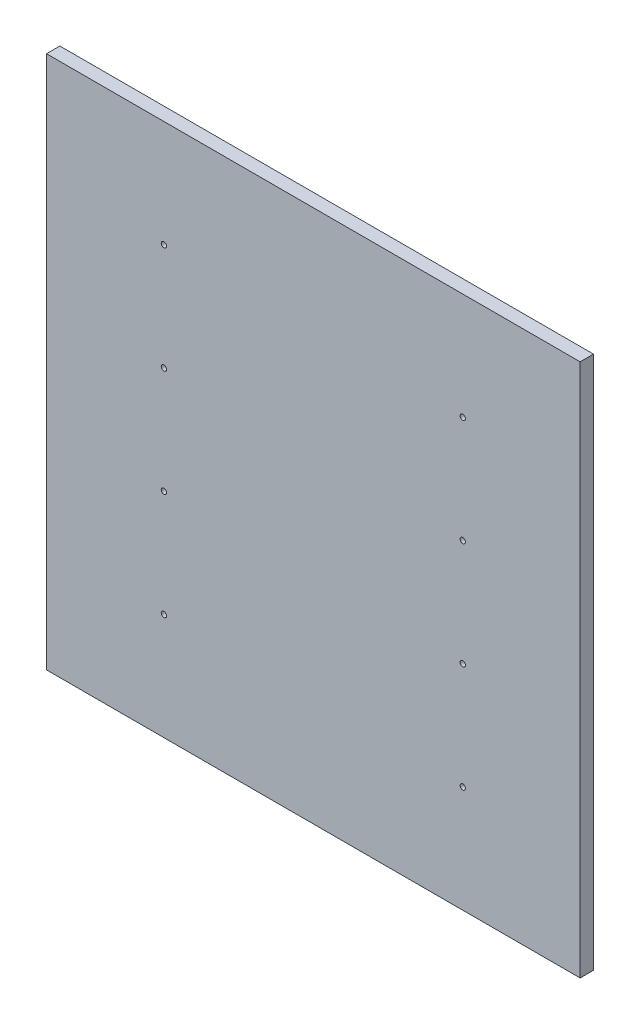
ISO-10303-21;
HEADER;
FILE_DESCRIPTION(('STEP AP214'),'2;1');
FILE_NAME('part.step','',(''),(''),'','','');
FILE_SCHEMA(('AUTOMOTIVE_DESIGN { 1 0 10303 214 1 1 1 1 }'));
ENDSEC;
DATA;
#1=APPLICATION_CONTEXT('core data for automotive mechanical design processes');
#2=APPLICATION_PROTOCOL_DEFINITION('international standard','automotive_design',2000,#1);
#3=PRODUCT_CONTEXT('',#1,'mechanical');
#4=PRODUCT('Part','Part','',(#3));
#5=PRODUCT_RELATED_PRODUCT_CATEGORY('part','',(#4));
#6=PRODUCT_DEFINITION_FORMATION('','',#4);
#7=PRODUCT_DEFINITION_CONTEXT('part definition',#1,'design');
#8=PRODUCT_DEFINITION('design','',#6,#7);
#9=PRODUCT_DEFINITION_SHAPE('','',#8);
#10=(LENGTH_UNIT() NAMED_UNIT(*) SI_UNIT(.MILLI.,.METRE.));
#11=(NAMED_UNIT(*) PLANE_ANGLE_UNIT() SI_UNIT($,.RADIAN.));
#12=(NAMED_UNIT(*) SI_UNIT($,.STERADIAN.) SOLID_ANGLE_UNIT());
#13=UNCERTAINTY_MEASURE_WITH_UNIT(LENGTH_MEASURE(1.E-05),#10,'distance_accuracy_value','');
#14=(GEOMETRIC_REPRESENTATION_CONTEXT(3) GLOBAL_UNCERTAINTY_ASSIGNED_CONTEXT((#13)) GLOBAL_UNIT_ASSIGNED_CONTEXT((#10,
#11,#12)) REPRESENTATION_CONTEXT('',''));
#15=CARTESIAN_POINT('',(0.,0.,0.));
#16=DIRECTION('',(0.,0.,1.));
#17=DIRECTION('',(1.,0.,0.));
#18=AXIS2_PLACEMENT_3D('',#15,#16,#17);
#19=CARTESIAN_POINT('',(45.,0.,1.));
#20=DIRECTION('',(1.,0.,0.));
#21=DIRECTION('',(0.,1.,0.));
#22=AXIS2_PLACEMENT_3D('',#19,#20,#21);
#23=PLANE('',#22);
#24=DIRECTION('',(0.,-1.,0.));
#25=VECTOR('',#24,1.);
#26=CARTESIAN_POINT('',(45.,0.,0.));
#27=LINE('',#26,#25);
#28=CARTESIAN_POINT('',(45.,-5.,0.));
#29=VERTEX_POINT('',#28);
#30=CARTESIAN_POINT('',(45.,-45.,0.));
#31=VERTEX_POINT('',#30);
#32=EDGE_CURVE('E98',#29,#31,#27,.T.);
#33=ORIENTED_EDGE('',*,*,#32,.F.);
#34=DIRECTION('',(0.,0.,-1.));
#35=VECTOR('',#34,1.);
#36=CARTESIAN_POINT('',(45.,-5.,1.));
#37=LINE('',#36,#35);
#38=CARTESIAN_POINT('',(45.,-5.,1.));
#39=VERTEX_POINT('',#38);
#40=EDGE_CURVE('E11',#39,#29,#37,.T.);
#41=ORIENTED_EDGE('',*,*,#40,.F.);
#42=DIRECTION('',(0.,-1.,0.));
#43=VECTOR('',#42,1.);
#44=CARTESIAN_POINT('',(45.,0.,1.));
#45=LINE('',#44,#43);
#46=CARTESIAN_POINT('',(45.,-45.,1.));
#47=VERTEX_POINT('',#46);
#48=EDGE_CURVE('E91',#39,#47,#45,.T.);
#49=ORIENTED_EDGE('',*,*,#48,.T.);
#50=DIRECTION('',(0.,0.,-1.));
#51=VECTOR('',#50,1.);
#52=CARTESIAN_POINT('',(45.,-45.,1.));
#53=LINE('',#52,#51);
#54=EDGE_CURVE('E72',#47,#31,#53,.T.);
#55=ORIENTED_EDGE('',*,*,#54,.T.);
#56=EDGE_LOOP('',(#33,#41,#49,#55));
#57=FACE_BOUND('',#56,.T.);
#58=ADVANCED_FACE('F34',(#57),#23,.T.);
#59=CARTESIAN_POINT('',(0.,-5.,1.));
#60=DIRECTION('',(0.,1.,0.));
#61=DIRECTION('',(0.,0.,1.));
#62=AXIS2_PLACEMENT_3D('',#59,#60,#61);
#63=PLANE('',#62);
#64=DIRECTION('',(1.,0.,0.));
#65=VECTOR('',#64,1.);
#66=CARTESIAN_POINT('',(0.,-5.,0.));
#67=LINE('',#66,#65);
#68=CARTESIAN_POINT('',(5.,-5.,0.));
#69=VERTEX_POINT('',#68);
#70=EDGE_CURVE('E85',#69,#29,#67,.T.);
#71=ORIENTED_EDGE('',*,*,#70,.F.);
#72=DIRECTION('',(0.,0.,-1.));
#73=VECTOR('',#72,1.);
#74=CARTESIAN_POINT('',(5.,-5.,1.));
#75=LINE('',#74,#73);
#76=CARTESIAN_POINT('',(5.,-5.,1.));
#77=VERTEX_POINT('',#76);
#78=EDGE_CURVE('E42',#77,#69,#75,.T.);
#79=ORIENTED_EDGE('',*,*,#78,.F.);
#80=DIRECTION('',(1.,0.,0.));
#81=VECTOR('',#80,1.);
#82=CARTESIAN_POINT('',(0.,-5.,1.));
#83=LINE('',#82,#81);
#84=EDGE_CURVE('E83',#77,#39,#83,.T.);
#85=ORIENTED_EDGE('',*,*,#84,.T.);
#86=ORIENTED_EDGE('',*,*,#40,.T.);
#87=EDGE_LOOP('',(#71,#79,#85,#86));
#88=FACE_BOUND('',#87,.T.);
#89=ADVANCED_FACE('F81',(#88),#63,.T.);
#90=CARTESIAN_POINT('',(5.,0.,1.));
#91=DIRECTION('',(1.,0.,0.));
#92=DIRECTION('',(0.,1.,0.));
#93=AXIS2_PLACEMENT_3D('',#90,#91,#92);
#94=PLANE('',#93);
#95=DIRECTION('',(0.,-1.,0.));
#96=VECTOR('',#95,1.);
#97=CARTESIAN_POINT('',(5.,0.,0.));
#98=LINE('',#97,#96);
#99=CARTESIAN_POINT('',(5.,-45.,0.));
#100=VERTEX_POINT('',#99);
#101=EDGE_CURVE('E65',#69,#100,#98,.T.);
#102=ORIENTED_EDGE('',*,*,#101,.T.);
#103=DIRECTION('',(0.,0.,-1.));
#104=VECTOR('',#103,1.);
#105=CARTESIAN_POINT('',(5.,-45.,1.));
#106=LINE('',#105,#104);
#107=CARTESIAN_POINT('',(5.,-45.,1.));
#108=VERTEX_POINT('',#107);
#109=EDGE_CURVE('E86',#108,#100,#106,.T.);
#110=ORIENTED_EDGE('',*,*,#109,.F.);
#111=DIRECTION('',(0.,-1.,0.));
#112=VECTOR('',#111,1.);
#113=CARTESIAN_POINT('',(5.,0.,1.));
#114=LINE('',#113,#112);
#115=EDGE_CURVE('E87',#77,#108,#114,.T.);
#116=ORIENTED_EDGE('',*,*,#115,.F.);
#117=ORIENTED_EDGE('',*,*,#78,.T.);
#118=EDGE_LOOP('',(#102,#110,#116,#117));
#119=FACE_BOUND('',#118,.T.);
#120=ADVANCED_FACE('F88',(#119),#94,.F.);
#121=CARTESIAN_POINT('',(0.,-45.,1.));
#122=DIRECTION('',(0.,1.,0.));
#123=DIRECTION('',(0.,0.,1.));
#124=AXIS2_PLACEMENT_3D('',#121,#122,#123);
#125=PLANE('',#124);
#126=DIRECTION('',(1.,0.,0.));
#127=VECTOR('',#126,1.);
#128=CARTESIAN_POINT('',(0.,-45.,0.));
#129=LINE('',#128,#127);
#130=EDGE_CURVE('E93',#100,#31,#129,.T.);
#131=ORIENTED_EDGE('',*,*,#130,.T.);
#132=ORIENTED_EDGE('',*,*,#54,.F.);
#133=DIRECTION('',(1.,0.,0.));
#134=VECTOR('',#133,1.);
#135=CARTESIAN_POINT('',(0.,-45.,1.));
#136=LINE('',#135,#134);
#137=EDGE_CURVE('E50',#108,#47,#136,.T.);
#138=ORIENTED_EDGE('',*,*,#137,.F.);
#139=ORIENTED_EDGE('',*,*,#109,.T.);
#140=EDGE_LOOP('',(#131,#132,#138,#139));
#141=FACE_BOUND('',#140,.T.);
#142=ADVANCED_FACE('F108',(#141),#125,.F.);
#143=CARTESIAN_POINT('',(0.,0.,1.));
#144=DIRECTION('',(0.,0.,1.));
#145=DIRECTION('',(1.,0.,0.));
#146=AXIS2_PLACEMENT_3D('',#143,#144,#145);
#147=PLANE('',#146);
#148=CARTESIAN_POINT('',(13.8,-21.,1.));
#149=DIRECTION('',(0.,0.,1.));
#150=DIRECTION('',(1.,0.,0.));
#151=AXIS2_PLACEMENT_3D('',#148,#149,#150);
#152=CIRCLE('',#151,0.2);
#153=CARTESIAN_POINT('',(14.,-21.,1.));
#154=VERTEX_POINT('',#153);
#155=EDGE_CURVE('E167',#154,#154,#152,.T.);
#156=ORIENTED_EDGE('',*,*,#155,.F.);
#157=EDGE_LOOP('',(#156));
#158=FACE_BOUND('',#157,.T.);
#159=CARTESIAN_POINT('',(13.8,-13.,1.));
#160=DIRECTION('',(0.,0.,1.));
#161=DIRECTION('',(1.,0.,0.));
#162=AXIS2_PLACEMENT_3D('',#159,#160,#161);
#163=CIRCLE('',#162,0.200000000000001);
#164=CARTESIAN_POINT('',(14.,-13.,1.));
#165=VERTEX_POINT('',#164);
#166=EDGE_CURVE('E171',#165,#165,#163,.T.);
#167=ORIENTED_EDGE('',*,*,#166,.F.);
#168=EDGE_LOOP('',(#167));
#169=FACE_BOUND('',#168,.T.);
#170=CARTESIAN_POINT('',(36.2,-13.,1.));
#171=DIRECTION('',(0.,0.,1.));
#172=DIRECTION('',(1.,0.,0.));
#173=AXIS2_PLACEMENT_3D('',#170,#171,#172);
#174=CIRCLE('',#173,0.199999999999996);
#175=CARTESIAN_POINT('',(36.4,-13.,1.));
#176=VERTEX_POINT('',#175);
#177=EDGE_CURVE('E178',#176,#176,#174,.T.);
#178=ORIENTED_EDGE('',*,*,#177,.F.);
#179=EDGE_LOOP('',(#178));
#180=FACE_BOUND('',#179,.T.);
#181=CARTESIAN_POINT('',(36.2,-21.,1.));
#182=DIRECTION('',(0.,0.,1.));
#183=DIRECTION('',(1.,0.,0.));
#184=AXIS2_PLACEMENT_3D('',#181,#182,#183);
#185=CIRCLE('',#184,0.199999999999995);
#186=CARTESIAN_POINT('',(36.4,-21.,1.));
#187=VERTEX_POINT('',#186);
#188=EDGE_CURVE('E184',#187,#187,#185,.T.);
#189=ORIENTED_EDGE('',*,*,#188,.F.);
#190=EDGE_LOOP('',(#189));
#191=FACE_BOUND('',#190,.T.);
#192=CARTESIAN_POINT('',(36.2,-37.,1.));
#193=DIRECTION('',(0.,0.,1.));
#194=DIRECTION('',(1.,0.,0.));
#195=AXIS2_PLACEMENT_3D('',#192,#193,#194);
#196=CIRCLE('',#195,0.199999999999995);
#197=CARTESIAN_POINT('',(36.4,-37.,1.));
#198=VERTEX_POINT('',#197);
#199=EDGE_CURVE('E190',#198,#198,#196,.T.);
#200=ORIENTED_EDGE('',*,*,#199,.F.);
#201=EDGE_LOOP('',(#200));
#202=FACE_BOUND('',#201,.T.);
#203=CARTESIAN_POINT('',(36.2,-29.,1.));
#204=DIRECTION('',(0.,0.,1.));
#205=DIRECTION('',(1.,0.,0.));
#206=AXIS2_PLACEMENT_3D('',#203,#204,#205);
#207=CIRCLE('',#206,0.199999999999995);
#208=CARTESIAN_POINT('',(36.4,-29.,1.));
#209=VERTEX_POINT('',#208);
#210=EDGE_CURVE('E196',#209,#209,#207,.T.);
#211=ORIENTED_EDGE('',*,*,#210,.F.);
#212=EDGE_LOOP('',(#211));
#213=FACE_BOUND('',#212,.T.);
#214=CARTESIAN_POINT('',(13.8,-29.,1.));
#215=DIRECTION('',(0.,0.,1.));
#216=DIRECTION('',(1.,0.,0.));
#217=AXIS2_PLACEMENT_3D('',#214,#215,#216);
#218=CIRCLE('',#217,0.2);
#219=CARTESIAN_POINT('',(14.,-29.,1.));
#220=VERTEX_POINT('',#219);
#221=EDGE_CURVE('E202',#220,#220,#218,.T.);
#222=ORIENTED_EDGE('',*,*,#221,.F.);
#223=EDGE_LOOP('',(#222));
#224=FACE_BOUND('',#223,.T.);
#225=CARTESIAN_POINT('',(13.8,-37.,1.));
#226=DIRECTION('',(0.,0.,1.));
#227=DIRECTION('',(1.,0.,0.));
#228=AXIS2_PLACEMENT_3D('',#225,#226,#227);
#229=CIRCLE('',#228,0.2);
#230=CARTESIAN_POINT('',(14.,-37.,1.));
#231=VERTEX_POINT('',#230);
#232=EDGE_CURVE('E205',#231,#231,#229,.T.);
#233=ORIENTED_EDGE('',*,*,#232,.F.);
#234=EDGE_LOOP('',(#233));
#235=FACE_BOUND('',#234,.T.);
#236=ORIENTED_EDGE('',*,*,#48,.F.);
#237=ORIENTED_EDGE('',*,*,#84,.F.);
#238=ORIENTED_EDGE('',*,*,#115,.T.);
#239=ORIENTED_EDGE('',*,*,#137,.T.);
#240=EDGE_LOOP('',(#236,#237,#238,#239));
#241=FACE_BOUND('',#240,.T.);
#242=ADVANCED_FACE('F90',(#158,#169,#180,#191,#202,#213,#224,#235,#241),#147,.T.);
#243=CARTESIAN_POINT('',(0.,0.,0.));
#244=DIRECTION('',(0.,0.,1.));
#245=DIRECTION('',(1.,0.,0.));
#246=AXIS2_PLACEMENT_3D('',#243,#244,#245);
#247=PLANE('',#246);
#248=CARTESIAN_POINT('',(13.8,-21.,0.));
#249=DIRECTION('',(0.,0.,1.));
#250=DIRECTION('',(1.,0.,0.));
#251=AXIS2_PLACEMENT_3D('',#248,#249,#250);
#252=CIRCLE('',#251,0.2);
#253=CARTESIAN_POINT('',(14.,-21.,0.));
#254=VERTEX_POINT('',#253);
#255=EDGE_CURVE('E164',#254,#254,#252,.T.);
#256=ORIENTED_EDGE('',*,*,#255,.T.);
#257=EDGE_LOOP('',(#256));
#258=FACE_BOUND('',#257,.T.);
#259=CARTESIAN_POINT('',(13.8,-13.,0.));
#260=DIRECTION('',(0.,0.,1.));
#261=DIRECTION('',(1.,0.,0.));
#262=AXIS2_PLACEMENT_3D('',#259,#260,#261);
#263=CIRCLE('',#262,0.200000000000001);
#264=CARTESIAN_POINT('',(14.,-13.,0.));
#265=VERTEX_POINT('',#264);
#266=EDGE_CURVE('E168',#265,#265,#263,.T.);
#267=ORIENTED_EDGE('',*,*,#266,.T.);
#268=EDGE_LOOP('',(#267));
#269=FACE_BOUND('',#268,.T.);
#270=CARTESIAN_POINT('',(36.2,-13.,0.));
#271=DIRECTION('',(0.,0.,1.));
#272=DIRECTION('',(1.,0.,0.));
#273=AXIS2_PLACEMENT_3D('',#270,#271,#272);
#274=CIRCLE('',#273,0.199999999999996);
#275=CARTESIAN_POINT('',(36.4,-13.,0.));
#276=VERTEX_POINT('',#275);
#277=EDGE_CURVE('E176',#276,#276,#274,.T.);
#278=ORIENTED_EDGE('',*,*,#277,.T.);
#279=EDGE_LOOP('',(#278));
#280=FACE_BOUND('',#279,.T.);
#281=CARTESIAN_POINT('',(36.2,-21.,0.));
#282=DIRECTION('',(0.,0.,1.));
#283=DIRECTION('',(1.,0.,0.));
#284=AXIS2_PLACEMENT_3D('',#281,#282,#283);
#285=CIRCLE('',#284,0.199999999999995);
#286=CARTESIAN_POINT('',(36.4,-21.,0.));
#287=VERTEX_POINT('',#286);
#288=EDGE_CURVE('E181',#287,#287,#285,.T.);
#289=ORIENTED_EDGE('',*,*,#288,.T.);
#290=EDGE_LOOP('',(#289));
#291=FACE_BOUND('',#290,.T.);
#292=CARTESIAN_POINT('',(36.2,-37.,0.));
#293=DIRECTION('',(0.,0.,1.));
#294=DIRECTION('',(1.,0.,0.));
#295=AXIS2_PLACEMENT_3D('',#292,#293,#294);
#296=CIRCLE('',#295,0.199999999999995);
#297=CARTESIAN_POINT('',(36.4,-37.,0.));
#298=VERTEX_POINT('',#297);
#299=EDGE_CURVE('E187',#298,#298,#296,.T.);
#300=ORIENTED_EDGE('',*,*,#299,.T.);
#301=EDGE_LOOP('',(#300));
#302=FACE_BOUND('',#301,.T.);
#303=CARTESIAN_POINT('',(36.2,-29.,0.));
#304=DIRECTION('',(0.,0.,1.));
#305=DIRECTION('',(1.,0.,0.));
#306=AXIS2_PLACEMENT_3D('',#303,#304,#305);
#307=CIRCLE('',#306,0.199999999999995);
#308=CARTESIAN_POINT('',(36.4,-29.,0.));
#309=VERTEX_POINT('',#308);
#310=EDGE_CURVE('E193',#309,#309,#307,.T.);
#311=ORIENTED_EDGE('',*,*,#310,.T.);
#312=EDGE_LOOP('',(#311));
#313=FACE_BOUND('',#312,.T.);
#314=CARTESIAN_POINT('',(13.8,-29.,0.));
#315=DIRECTION('',(0.,0.,1.));
#316=DIRECTION('',(1.,0.,0.));
#317=AXIS2_PLACEMENT_3D('',#314,#315,#316);
#318=CIRCLE('',#317,0.2);
#319=CARTESIAN_POINT('',(14.,-29.,0.));
#320=VERTEX_POINT('',#319);
#321=EDGE_CURVE('E199',#320,#320,#318,.T.);
#322=ORIENTED_EDGE('',*,*,#321,.T.);
#323=EDGE_LOOP('',(#322));
#324=FACE_BOUND('',#323,.T.);
#325=CARTESIAN_POINT('',(13.8,-37.,0.));
#326=DIRECTION('',(0.,0.,1.));
#327=DIRECTION('',(1.,0.,0.));
#328=AXIS2_PLACEMENT_3D('',#325,#326,#327);
#329=CIRCLE('',#328,0.2);
#330=CARTESIAN_POINT('',(14.,-37.,0.));
#331=VERTEX_POINT('',#330);
#332=EDGE_CURVE('E101',#331,#331,#329,.T.);
#333=ORIENTED_EDGE('',*,*,#332,.T.);
#334=EDGE_LOOP('',(#333));
#335=FACE_BOUND('',#334,.T.);
#336=ORIENTED_EDGE('',*,*,#32,.T.);
#337=ORIENTED_EDGE('',*,*,#130,.F.);
#338=ORIENTED_EDGE('',*,*,#101,.F.);
#339=ORIENTED_EDGE('',*,*,#70,.T.);
#340=EDGE_LOOP('',(#336,#337,#338,#339));
#341=FACE_BOUND('',#340,.T.);
#342=ADVANCED_FACE('F110',(#258,#269,#280,#291,#302,#313,#324,#335,#341),#247,.F.);
#343=CARTESIAN_POINT('',(13.8,-37.,0.));
#344=DIRECTION('',(0.,0.,1.));
#345=DIRECTION('',(1.,0.,0.));
#346=AXIS2_PLACEMENT_3D('',#343,#344,#345);
#347=CYLINDRICAL_SURFACE('',#346,0.2);
#348=ORIENTED_EDGE('',*,*,#332,.F.);
#349=EDGE_LOOP('',(#348));
#350=FACE_BOUND('',#349,.T.);
#351=ORIENTED_EDGE('',*,*,#232,.T.);
#352=EDGE_LOOP('',(#351));
#353=FACE_BOUND('',#352,.T.);
#354=ADVANCED_FACE('F124',(#350,#353),#347,.F.);
#355=CARTESIAN_POINT('',(13.8,-29.,0.));
#356=DIRECTION('',(0.,0.,1.));
#357=DIRECTION('',(1.,0.,0.));
#358=AXIS2_PLACEMENT_3D('',#355,#356,#357);
#359=CYLINDRICAL_SURFACE('',#358,0.2);
#360=ORIENTED_EDGE('',*,*,#321,.F.);
#361=EDGE_LOOP('',(#360));
#362=FACE_BOUND('',#361,.T.);
#363=ORIENTED_EDGE('',*,*,#221,.T.);
#364=EDGE_LOOP('',(#363));
#365=FACE_BOUND('',#364,.T.);
#366=ADVANCED_FACE('F131',(#362,#365),#359,.F.);
#367=CARTESIAN_POINT('',(36.2,-29.,0.));
#368=DIRECTION('',(0.,0.,1.));
#369=DIRECTION('',(1.,0.,0.));
#370=AXIS2_PLACEMENT_3D('',#367,#368,#369);
#371=CYLINDRICAL_SURFACE('',#370,0.199999999999995);
#372=ORIENTED_EDGE('',*,*,#310,.F.);
#373=EDGE_LOOP('',(#372));
#374=FACE_BOUND('',#373,.T.);
#375=ORIENTED_EDGE('',*,*,#210,.T.);
#376=EDGE_LOOP('',(#375));
#377=FACE_BOUND('',#376,.T.);
#378=ADVANCED_FACE('F135',(#374,#377),#371,.F.);
#379=CARTESIAN_POINT('',(36.2,-37.,0.));
#380=DIRECTION('',(0.,0.,1.));
#381=DIRECTION('',(1.,0.,0.));
#382=AXIS2_PLACEMENT_3D('',#379,#380,#381);
#383=CYLINDRICAL_SURFACE('',#382,0.199999999999995);
#384=ORIENTED_EDGE('',*,*,#299,.F.);
#385=EDGE_LOOP('',(#384));
#386=FACE_BOUND('',#385,.T.);
#387=ORIENTED_EDGE('',*,*,#199,.T.);
#388=EDGE_LOOP('',(#387));
#389=FACE_BOUND('',#388,.T.);
#390=ADVANCED_FACE('F139',(#386,#389),#383,.F.);
#391=CARTESIAN_POINT('',(36.2,-21.,0.));
#392=DIRECTION('',(0.,0.,1.));
#393=DIRECTION('',(1.,0.,0.));
#394=AXIS2_PLACEMENT_3D('',#391,#392,#393);
#395=CYLINDRICAL_SURFACE('',#394,0.199999999999995);
#396=ORIENTED_EDGE('',*,*,#288,.F.);
#397=EDGE_LOOP('',(#396));
#398=FACE_BOUND('',#397,.T.);
#399=ORIENTED_EDGE('',*,*,#188,.T.);
#400=EDGE_LOOP('',(#399));
#401=FACE_BOUND('',#400,.T.);
#402=ADVANCED_FACE('F143',(#398,#401),#395,.F.);
#403=CARTESIAN_POINT('',(36.2,-13.,0.));
#404=DIRECTION('',(0.,0.,1.));
#405=DIRECTION('',(1.,0.,0.));
#406=AXIS2_PLACEMENT_3D('',#403,#404,#405);
#407=CYLINDRICAL_SURFACE('',#406,0.199999999999996);
#408=ORIENTED_EDGE('',*,*,#277,.F.);
#409=EDGE_LOOP('',(#408));
#410=FACE_BOUND('',#409,.T.);
#411=ORIENTED_EDGE('',*,*,#177,.T.);
#412=EDGE_LOOP('',(#411));
#413=FACE_BOUND('',#412,.T.);
#414=ADVANCED_FACE('F147',(#410,#413),#407,.F.);
#415=CARTESIAN_POINT('',(13.8,-13.,0.));
#416=DIRECTION('',(0.,0.,1.));
#417=DIRECTION('',(1.,0.,0.));
#418=AXIS2_PLACEMENT_3D('',#415,#416,#417);
#419=CYLINDRICAL_SURFACE('',#418,0.200000000000001);
#420=ORIENTED_EDGE('',*,*,#266,.F.);
#421=EDGE_LOOP('',(#420));
#422=FACE_BOUND('',#421,.T.);
#423=ORIENTED_EDGE('',*,*,#166,.T.);
#424=EDGE_LOOP('',(#423));
#425=FACE_BOUND('',#424,.T.);
#426=ADVANCED_FACE('F151',(#422,#425),#419,.F.);
#427=CARTESIAN_POINT('',(13.8,-21.,0.));
#428=DIRECTION('',(0.,0.,1.));
#429=DIRECTION('',(1.,0.,0.));
#430=AXIS2_PLACEMENT_3D('',#427,#428,#429);
#431=CYLINDRICAL_SURFACE('',#430,0.2);
#432=ORIENTED_EDGE('',*,*,#255,.F.);
#433=EDGE_LOOP('',(#432));
#434=FACE_BOUND('',#433,.T.);
#435=ORIENTED_EDGE('',*,*,#155,.T.);
#436=EDGE_LOOP('',(#435));
#437=FACE_BOUND('',#436,.T.);
#438=ADVANCED_FACE('F155',(#434,#437),#431,.F.);
#439=CLOSED_SHELL('',(#58,#89,#120,#142,#242,#342,#354,#366,#378,#390,#402,#414,#426,#438));
#440=MANIFOLD_SOLID_BREP('B2',#439);
#441=ADVANCED_BREP_SHAPE_REPRESENTATION('',(#18,#440),#14);
#442=SHAPE_DEFINITION_REPRESENTATION(#9,#441);
ENDSEC;
END-ISO-10303-21;
